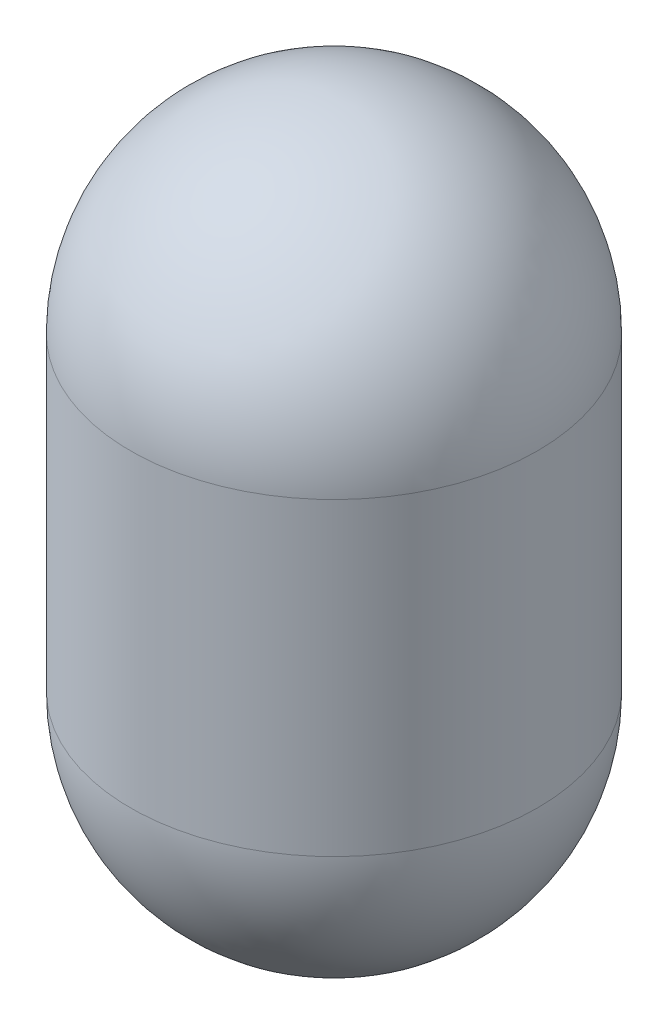
ISO-10303-21;
HEADER;
FILE_DESCRIPTION(('STEP AP214'),'2;1');
FILE_NAME('part.step','',(''),(''),'','','');
FILE_SCHEMA(('AUTOMOTIVE_DESIGN { 1 0 10303 214 1 1 1 1 }'));
ENDSEC;
DATA;
#1=APPLICATION_CONTEXT('core data for automotive mechanical design processes');
#2=APPLICATION_PROTOCOL_DEFINITION('international standard','automotive_design',2000,#1);
#3=PRODUCT_CONTEXT('',#1,'mechanical');
#4=PRODUCT('Part','Part','',(#3));
#5=PRODUCT_RELATED_PRODUCT_CATEGORY('part','',(#4));
#6=PRODUCT_DEFINITION_FORMATION('','',#4);
#7=PRODUCT_DEFINITION_CONTEXT('part definition',#1,'design');
#8=PRODUCT_DEFINITION('design','',#6,#7);
#9=PRODUCT_DEFINITION_SHAPE('','',#8);
#10=(LENGTH_UNIT() NAMED_UNIT(*) SI_UNIT(.MILLI.,.METRE.));
#11=(NAMED_UNIT(*) PLANE_ANGLE_UNIT() SI_UNIT($,.RADIAN.));
#12=(NAMED_UNIT(*) SI_UNIT($,.STERADIAN.) SOLID_ANGLE_UNIT());
#13=UNCERTAINTY_MEASURE_WITH_UNIT(LENGTH_MEASURE(1.E-05),#10,'distance_accuracy_value','');
#14=(GEOMETRIC_REPRESENTATION_CONTEXT(3) GLOBAL_UNCERTAINTY_ASSIGNED_CONTEXT((#13)) GLOBAL_UNIT_ASSIGNED_CONTEXT((#10,
#11,#12)) REPRESENTATION_CONTEXT('',''));
#15=CARTESIAN_POINT('',(0.,0.,0.));
#16=DIRECTION('',(0.,0.,1.));
#17=DIRECTION('',(1.,0.,0.));
#18=AXIS2_PLACEMENT_3D('',#15,#16,#17);
#19=CARTESIAN_POINT('',(125.,0.,0.));
#20=DIRECTION('',(0.,1.,0.));
#21=DIRECTION('',(-1.,0.,0.));
#22=AXIS2_PLACEMENT_3D('',#19,#20,#21);
#23=SPHERICAL_SURFACE('',#22,125.);
#24=CARTESIAN_POINT('',(125.,0.,0.));
#25=DIRECTION('',(0.,1.,0.));
#26=DIRECTION('',(-1.,0.,0.));
#27=AXIS2_PLACEMENT_3D('',#24,#25,#26);
#28=CIRCLE('',#27,125.);
#29=CARTESIAN_POINT('',(0.,0.,0.));
#30=VERTEX_POINT('',#29);
#31=EDGE_CURVE('E47',#30,#30,#28,.T.);
#32=ORIENTED_EDGE('',*,*,#31,.F.);
#33=EDGE_LOOP('',(#32));
#34=FACE_BOUND('',#33,.T.);
#35=ADVANCED_FACE('F32',(#34),#23,.T.);
#36=CARTESIAN_POINT('',(125.,190.,0.));
#37=DIRECTION('',(0.,1.,0.));
#38=DIRECTION('',(-1.,0.,0.));
#39=AXIS2_PLACEMENT_3D('',#36,#37,#38);
#40=SPHERICAL_SURFACE('',#39,125.);
#41=CARTESIAN_POINT('',(125.,190.,0.));
#42=DIRECTION('',(0.,1.,0.));
#43=DIRECTION('',(-1.,0.,0.));
#44=AXIS2_PLACEMENT_3D('',#41,#42,#43);
#45=CIRCLE('',#44,125.);
#46=CARTESIAN_POINT('',(0.,190.,0.));
#47=VERTEX_POINT('',#46);
#48=EDGE_CURVE('E43',#47,#47,#45,.T.);
#49=ORIENTED_EDGE('',*,*,#48,.T.);
#50=EDGE_LOOP('',(#49));
#51=FACE_BOUND('',#50,.T.);
#52=ADVANCED_FACE('F57',(#51),#40,.T.);
#53=CARTESIAN_POINT('',(125.,315.,0.));
#54=DIRECTION('',(0.,1.,0.));
#55=DIRECTION('',(-1.,0.,0.));
#56=AXIS2_PLACEMENT_3D('',#53,#54,#55);
#57=CYLINDRICAL_SURFACE('',#56,125.);
#58=ORIENTED_EDGE('',*,*,#31,.T.);
#59=EDGE_LOOP('',(#58));
#60=FACE_BOUND('',#59,.T.);
#61=ORIENTED_EDGE('',*,*,#48,.F.);
#62=EDGE_LOOP('',(#61));
#63=FACE_BOUND('',#62,.T.);
#64=ADVANCED_FACE('F53',(#60,#63),#57,.T.);
#65=CLOSED_SHELL('',(#35,#52,#64));
#66=CARTESIAN_POINT('',(125.,0.,0.));
#67=DIRECTION('',(0.,1.,0.));
#68=DIRECTION('',(-1.,0.,0.));
#69=AXIS2_PLACEMENT_3D('',#66,#67,#68);
#70=SPHERICAL_SURFACE('',#69,115.);
#71=CARTESIAN_POINT('',(125.,0.,0.));
#72=DIRECTION('',(0.,1.,0.));
#73=DIRECTION('',(-1.,0.,0.));
#74=AXIS2_PLACEMENT_3D('',#71,#72,#73);
#75=CIRCLE('',#74,115.);
#76=CARTESIAN_POINT('',(9.99999999999998,0.,0.));
#77=VERTEX_POINT('',#76);
#78=EDGE_CURVE('E10',#77,#77,#75,.T.);
#79=ORIENTED_EDGE('',*,*,#78,.T.);
#80=EDGE_LOOP('',(#79));
#81=FACE_BOUND('',#80,.T.);
#82=ADVANCED_FACE('F75',(#81),#70,.F.);
#83=CARTESIAN_POINT('',(125.,315.,0.));
#84=DIRECTION('',(0.,1.,0.));
#85=DIRECTION('',(-1.,0.,0.));
#86=AXIS2_PLACEMENT_3D('',#83,#84,#85);
#87=CYLINDRICAL_SURFACE('',#86,115.);
#88=CARTESIAN_POINT('',(125.,190.,0.));
#89=DIRECTION('',(0.,1.,0.));
#90=DIRECTION('',(-1.,0.,0.));
#91=AXIS2_PLACEMENT_3D('',#88,#89,#90);
#92=CIRCLE('',#91,115.);
#93=CARTESIAN_POINT('',(10.,190.,0.));
#94=VERTEX_POINT('',#93);
#95=EDGE_CURVE('E39',#94,#94,#92,.T.);
#96=ORIENTED_EDGE('',*,*,#95,.T.);
#97=EDGE_LOOP('',(#96));
#98=FACE_BOUND('',#97,.T.);
#99=ORIENTED_EDGE('',*,*,#78,.F.);
#100=EDGE_LOOP('',(#99));
#101=FACE_BOUND('',#100,.T.);
#102=ADVANCED_FACE('F71',(#98,#101),#87,.F.);
#103=CARTESIAN_POINT('',(125.,190.,0.));
#104=DIRECTION('',(0.,1.,0.));
#105=DIRECTION('',(-1.,0.,0.));
#106=AXIS2_PLACEMENT_3D('',#103,#104,#105);
#107=SPHERICAL_SURFACE('',#106,115.);
#108=ORIENTED_EDGE('',*,*,#95,.F.);
#109=EDGE_LOOP('',(#108));
#110=FACE_BOUND('',#109,.T.);
#111=ADVANCED_FACE('F68',(#110),#107,.F.);
#112=CLOSED_SHELL('',(#82,#102,#111));
#113=ORIENTED_CLOSED_SHELL('',*,#112,.T.);
#114=BREP_WITH_VOIDS('B2',#65,(#113));
#115=ADVANCED_BREP_SHAPE_REPRESENTATION('',(#18,#114),#14);
#116=SHAPE_DEFINITION_REPRESENTATION(#9,#115);
ENDSEC;
END-ISO-10303-21;
